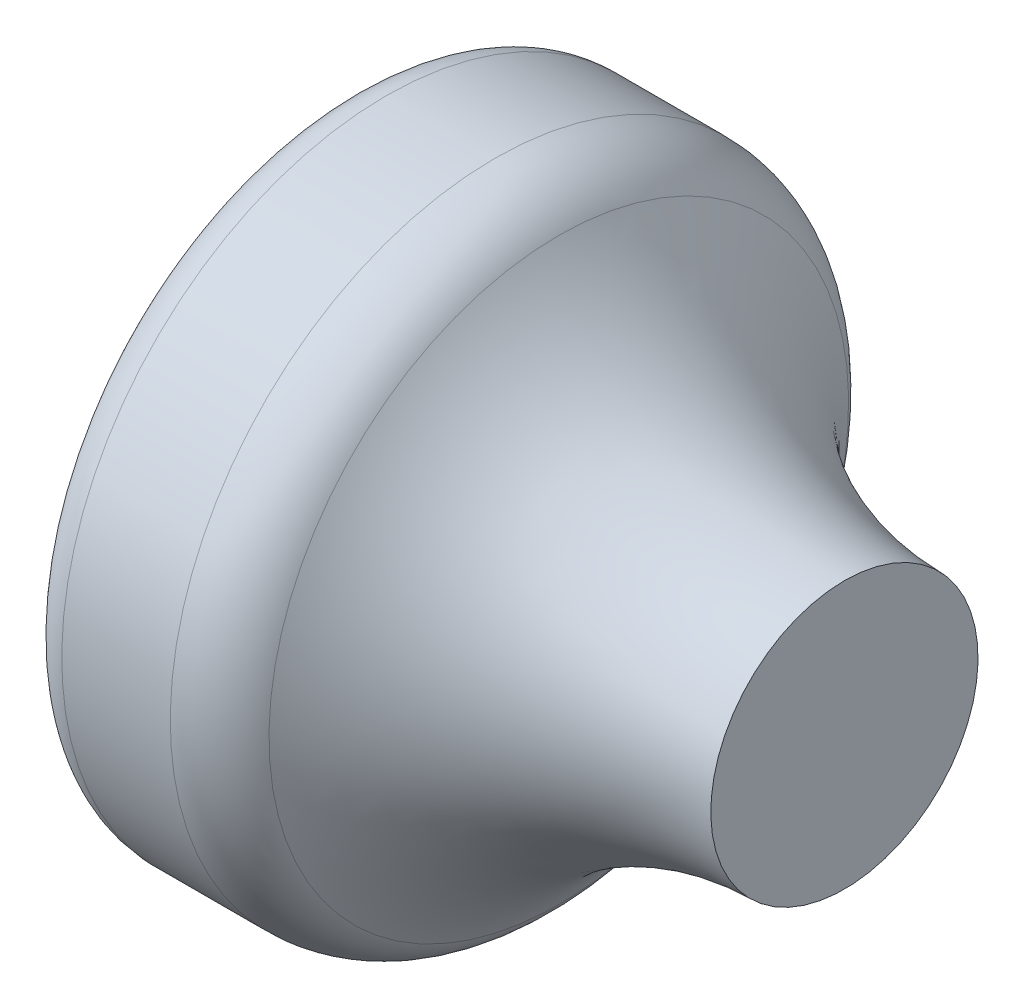
ISO-10303-21;
HEADER;
FILE_DESCRIPTION(('STEP AP214'),'2;1');
FILE_NAME('part.step','',(''),(''),'','','');
FILE_SCHEMA(('AUTOMOTIVE_DESIGN { 1 0 10303 214 1 1 1 1 }'));
ENDSEC;
DATA;
#1=APPLICATION_CONTEXT('core data for automotive mechanical design processes');
#2=APPLICATION_PROTOCOL_DEFINITION('international standard','automotive_design',2000,#1);
#3=PRODUCT_CONTEXT('',#1,'mechanical');
#4=PRODUCT('Part','Part','',(#3));
#5=PRODUCT_RELATED_PRODUCT_CATEGORY('part','',(#4));
#6=PRODUCT_DEFINITION_FORMATION('','',#4);
#7=PRODUCT_DEFINITION_CONTEXT('part definition',#1,'design');
#8=PRODUCT_DEFINITION('design','',#6,#7);
#9=PRODUCT_DEFINITION_SHAPE('','',#8);
#10=(LENGTH_UNIT() NAMED_UNIT(*) SI_UNIT(.MILLI.,.METRE.));
#11=(NAMED_UNIT(*) PLANE_ANGLE_UNIT() SI_UNIT($,.RADIAN.));
#12=(NAMED_UNIT(*) SI_UNIT($,.STERADIAN.) SOLID_ANGLE_UNIT());
#13=UNCERTAINTY_MEASURE_WITH_UNIT(LENGTH_MEASURE(1.E-05),#10,'distance_accuracy_value','');
#14=(GEOMETRIC_REPRESENTATION_CONTEXT(3) GLOBAL_UNCERTAINTY_ASSIGNED_CONTEXT((#13)) GLOBAL_UNIT_ASSIGNED_CONTEXT((#10,
#11,#12)) REPRESENTATION_CONTEXT('',''));
#15=CARTESIAN_POINT('',(0.,0.,0.));
#16=DIRECTION('',(0.,0.,1.));
#17=DIRECTION('',(1.,0.,0.));
#18=AXIS2_PLACEMENT_3D('',#15,#16,#17);
#19=CARTESIAN_POINT('',(-13.,0.,0.));
#20=DIRECTION('',(-1.,0.,0.));
#21=DIRECTION('',(0.,-1.,0.));
#22=AXIS2_PLACEMENT_3D('',#19,#20,#21);
#23=PLANE('',#22);
#24=CARTESIAN_POINT('',(-13.,0.,0.));
#25=DIRECTION('',(1.,0.,0.));
#26=DIRECTION('',(0.,1.,0.));
#27=AXIS2_PLACEMENT_3D('',#24,#25,#26);
#28=CIRCLE('',#27,7.5);
#29=CARTESIAN_POINT('',(-13.,7.5,0.));
#30=VERTEX_POINT('',#29);
#31=EDGE_CURVE('E10',#30,#30,#28,.T.);
#32=ORIENTED_EDGE('',*,*,#31,.F.);
#33=EDGE_LOOP('',(#32));
#34=FACE_BOUND('',#33,.T.);
#35=ADVANCED_FACE('F31',(#34),#23,.T.);
#36=CARTESIAN_POINT('',(-12.,0.,0.));
#37=DIRECTION('',(1.,0.,0.));
#38=DIRECTION('',(0.,1.,0.));
#39=AXIS2_PLACEMENT_3D('',#36,#37,#38);
#40=TOROIDAL_SURFACE('',#39,7.5,1.);
#41=ORIENTED_EDGE('',*,*,#31,.T.);
#42=EDGE_LOOP('',(#41));
#43=FACE_BOUND('',#42,.T.);
#44=CARTESIAN_POINT('',(-12.,0.,0.));
#45=DIRECTION('',(1.,0.,0.));
#46=DIRECTION('',(0.,1.,0.));
#47=AXIS2_PLACEMENT_3D('',#44,#45,#46);
#48=CIRCLE('',#47,8.5);
#49=CARTESIAN_POINT('',(-12.,8.5,0.));
#50=VERTEX_POINT('',#49);
#51=EDGE_CURVE('E37',#50,#50,#48,.T.);
#52=ORIENTED_EDGE('',*,*,#51,.F.);
#53=EDGE_LOOP('',(#52));
#54=FACE_BOUND('',#53,.T.);
#55=ADVANCED_FACE('F70',(#43,#54),#40,.T.);
#56=CARTESIAN_POINT('',(0.,0.,0.));
#57=DIRECTION('',(1.,0.,0.));
#58=DIRECTION('',(0.,1.,0.));
#59=AXIS2_PLACEMENT_3D('',#56,#57,#58);
#60=CYLINDRICAL_SURFACE('',#59,8.5);
#61=ORIENTED_EDGE('',*,*,#51,.T.);
#62=EDGE_LOOP('',(#61));
#63=FACE_BOUND('',#62,.T.);
#64=CARTESIAN_POINT('',(-9.15732012624225,0.,0.));
#65=DIRECTION('',(1.,0.,0.));
#66=DIRECTION('',(0.,1.,0.));
#67=AXIS2_PLACEMENT_3D('',#64,#65,#66);
#68=CIRCLE('',#67,8.5);
#69=CARTESIAN_POINT('',(-9.15732012624225,8.5,0.));
#70=VERTEX_POINT('',#69);
#71=EDGE_CURVE('E41',#70,#70,#68,.T.);
#72=ORIENTED_EDGE('',*,*,#71,.F.);
#73=EDGE_LOOP('',(#72));
#74=FACE_BOUND('',#73,.T.);
#75=ADVANCED_FACE('F66',(#63,#74),#60,.T.);
#76=CARTESIAN_POINT('',(-9.15732012624225,0.,0.));
#77=DIRECTION('',(1.,0.,0.));
#78=DIRECTION('',(0.,1.,0.));
#79=AXIS2_PLACEMENT_3D('',#76,#77,#78);
#80=TOROIDAL_SURFACE('',#79,6.5,2.);
#81=ORIENTED_EDGE('',*,*,#71,.T.);
#82=EDGE_LOOP('',(#81));
#83=FACE_BOUND('',#82,.T.);
#84=CARTESIAN_POINT('',(-7.48101374870392,0.,0.));
#85=DIRECTION('',(1.,0.,0.));
#86=DIRECTION('',(0.,1.,0.));
#87=AXIS2_PLACEMENT_3D('',#84,#85,#86);
#88=CIRCLE('',#87,7.59086980369994);
#89=CARTESIAN_POINT('',(-7.48101374870392,7.59086980369993,0.));
#90=VERTEX_POINT('',#89);
#91=EDGE_CURVE('E45',#90,#90,#88,.T.);
#92=ORIENTED_EDGE('',*,*,#91,.F.);
#93=EDGE_LOOP('',(#92));
#94=FACE_BOUND('',#93,.T.);
#95=ADVANCED_FACE('F58',(#83,#94),#80,.T.);
#96=CARTESIAN_POINT('',(0.0623649502185352,0.,0.));
#97=DIRECTION('',(1.,0.,0.));
#98=DIRECTION('',(0.,1.,0.));
#99=AXIS2_PLACEMENT_3D('',#96,#97,#98);
#100=TOROIDAL_SURFACE('',#99,12.4997839203497,9.);
#101=ORIENTED_EDGE('',*,*,#91,.T.);
#102=EDGE_LOOP('',(#101));
#103=FACE_BOUND('',#102,.T.);
#104=CARTESIAN_POINT('',(0.,0.,0.));
#105=DIRECTION('',(1.,0.,0.));
#106=DIRECTION('',(0.,1.,0.));
#107=AXIS2_PLACEMENT_3D('',#104,#105,#106);
#108=CIRCLE('',#107,3.5);
#109=CARTESIAN_POINT('',(0.,3.5,0.));
#110=VERTEX_POINT('',#109);
#111=EDGE_CURVE('E50',#110,#110,#108,.T.);
#112=ORIENTED_EDGE('',*,*,#111,.F.);
#113=EDGE_LOOP('',(#112));
#114=FACE_BOUND('',#113,.T.);
#115=ADVANCED_FACE('F56',(#103,#114),#100,.F.);
#116=CARTESIAN_POINT('',(0.,3.5,0.));
#117=DIRECTION('',(1.,0.,0.));
#118=DIRECTION('',(0.,1.,0.));
#119=AXIS2_PLACEMENT_3D('',#116,#117,#118);
#120=PLANE('',#119);
#121=ORIENTED_EDGE('',*,*,#111,.T.);
#122=EDGE_LOOP('',(#121));
#123=FACE_BOUND('',#122,.T.);
#124=ADVANCED_FACE('F54',(#123),#120,.T.);
#125=CLOSED_SHELL('',(#35,#55,#75,#95,#115,#124));
#126=MANIFOLD_SOLID_BREP('B2',#125);
#127=ADVANCED_BREP_SHAPE_REPRESENTATION('',(#18,#126),#14);
#128=SHAPE_DEFINITION_REPRESENTATION(#9,#127);
ENDSEC;
END-ISO-10303-21;
